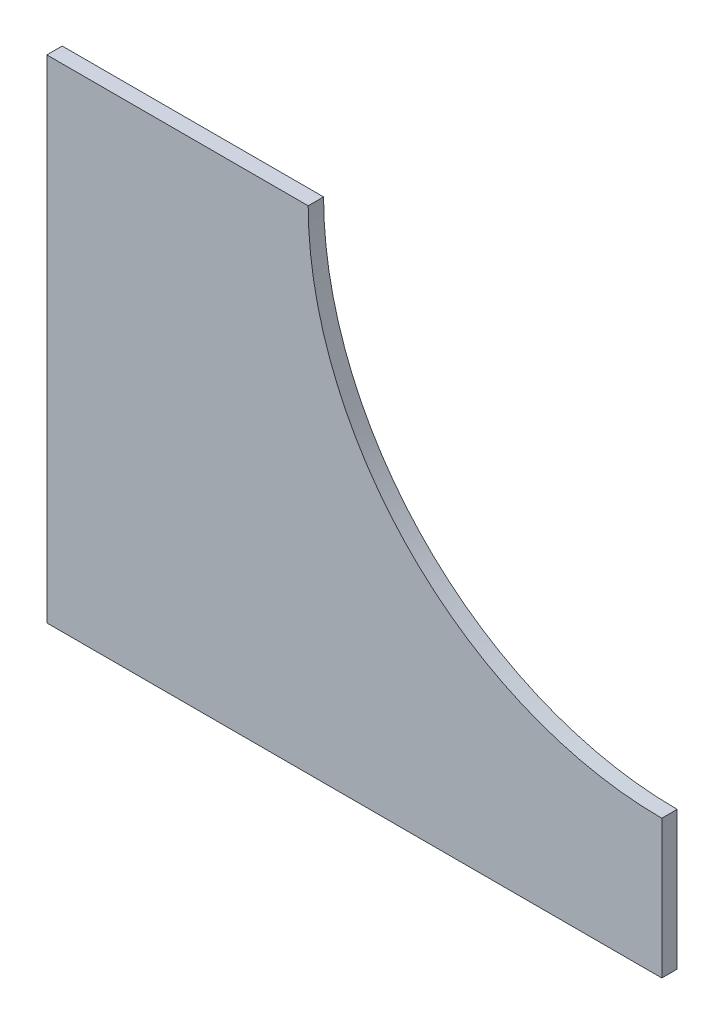
ISO-10303-21;
HEADER;
FILE_DESCRIPTION(('STEP AP214'),'2;1');
FILE_NAME('part.step','',(''),(''),'','','');
FILE_SCHEMA(('AUTOMOTIVE_DESIGN { 1 0 10303 214 1 1 1 1 }'));
ENDSEC;
DATA;
#1=APPLICATION_CONTEXT('core data for automotive mechanical design processes');
#2=APPLICATION_PROTOCOL_DEFINITION('international standard','automotive_design',2000,#1);
#3=PRODUCT_CONTEXT('',#1,'mechanical');
#4=PRODUCT('Part','Part','',(#3));
#5=PRODUCT_RELATED_PRODUCT_CATEGORY('part','',(#4));
#6=PRODUCT_DEFINITION_FORMATION('','',#4);
#7=PRODUCT_DEFINITION_CONTEXT('part definition',#1,'design');
#8=PRODUCT_DEFINITION('design','',#6,#7);
#9=PRODUCT_DEFINITION_SHAPE('','',#8);
#10=(LENGTH_UNIT() NAMED_UNIT(*) SI_UNIT(.MILLI.,.METRE.));
#11=(NAMED_UNIT(*) PLANE_ANGLE_UNIT() SI_UNIT($,.RADIAN.));
#12=(NAMED_UNIT(*) SI_UNIT($,.STERADIAN.) SOLID_ANGLE_UNIT());
#13=UNCERTAINTY_MEASURE_WITH_UNIT(LENGTH_MEASURE(1.E-05),#10,'distance_accuracy_value','');
#14=(GEOMETRIC_REPRESENTATION_CONTEXT(3) GLOBAL_UNCERTAINTY_ASSIGNED_CONTEXT((#13)) GLOBAL_UNIT_ASSIGNED_CONTEXT((#10,
#11,#12)) REPRESENTATION_CONTEXT('',''));
#15=CARTESIAN_POINT('',(0.,0.,0.));
#16=DIRECTION('',(0.,0.,1.));
#17=DIRECTION('',(1.,0.,0.));
#18=AXIS2_PLACEMENT_3D('',#15,#16,#17);
#19=CARTESIAN_POINT('',(98.4294784744164,-123.629958099048,-3.175));
#20=DIRECTION('',(0.,0.,1.));
#21=DIRECTION('',(-1.,0.,0.));
#22=AXIS2_PLACEMENT_3D('',#19,#20,#21);
#23=CYLINDRICAL_SURFACE('',#22,73.0250000000014);
#24=CARTESIAN_POINT('',(98.4294784744164,-123.629958099048,0.));
#25=DIRECTION('',(0.,0.,-1.));
#26=DIRECTION('',(-1.,0.,0.));
#27=AXIS2_PLACEMENT_3D('',#24,#25,#26);
#28=CIRCLE('',#27,73.0250000000014);
#29=CARTESIAN_POINT('',(98.4294784744164,-196.654958099049,0.));
#30=VERTEX_POINT('',#29);
#31=CARTESIAN_POINT('',(25.404478474415,-123.62995809905,0.));
#32=VERTEX_POINT('',#31);
#33=EDGE_CURVE('E112',#30,#32,#28,.T.);
#34=ORIENTED_EDGE('',*,*,#33,.F.);
#35=DIRECTION('',(0.,0.,1.));
#36=VECTOR('',#35,1.);
#37=CARTESIAN_POINT('',(98.4294784744164,-196.654958099049,-3.175));
#38=LINE('',#37,#36);
#39=CARTESIAN_POINT('',(98.4294784744164,-196.654958099049,-3.175));
#40=VERTEX_POINT('',#39);
#41=EDGE_CURVE('E111',#40,#30,#38,.T.);
#42=ORIENTED_EDGE('',*,*,#41,.F.);
#43=CARTESIAN_POINT('',(98.4294784744164,-123.629958099048,-3.175));
#44=DIRECTION('',(0.,0.,-1.));
#45=DIRECTION('',(-1.,0.,0.));
#46=AXIS2_PLACEMENT_3D('',#43,#44,#45);
#47=CIRCLE('',#46,73.0250000000014);
#48=CARTESIAN_POINT('',(25.404478474415,-123.62995809905,-3.175));
#49=VERTEX_POINT('',#48);
#50=EDGE_CURVE('E106',#40,#49,#47,.T.);
#51=ORIENTED_EDGE('',*,*,#50,.T.);
#52=DIRECTION('',(0.,0.,1.));
#53=VECTOR('',#52,1.);
#54=CARTESIAN_POINT('',(25.404478474415,-123.62995809905,-3.175));
#55=LINE('',#54,#53);
#56=EDGE_CURVE('E11',#49,#32,#55,.T.);
#57=ORIENTED_EDGE('',*,*,#56,.T.);
#58=EDGE_LOOP('',(#34,#42,#51,#57));
#59=FACE_BOUND('',#58,.T.);
#60=ADVANCED_FACE('F37',(#59),#23,.F.);
#61=CARTESIAN_POINT('',(-28.570521525585,-123.62995809905,-3.175));
#62=DIRECTION('',(0.,-1.,0.));
#63=DIRECTION('',(1.,0.,0.));
#64=AXIS2_PLACEMENT_3D('',#61,#62,#63);
#65=PLANE('',#64);
#66=DIRECTION('',(-1.,0.,0.));
#67=VECTOR('',#66,1.);
#68=CARTESIAN_POINT('',(-28.570521525585,-123.62995809905,0.));
#69=LINE('',#68,#67);
#70=CARTESIAN_POINT('',(-28.570521525585,-123.62995809905,0.));
#71=VERTEX_POINT('',#70);
#72=EDGE_CURVE('E114',#32,#71,#69,.T.);
#73=ORIENTED_EDGE('',*,*,#72,.F.);
#74=ORIENTED_EDGE('',*,*,#56,.F.);
#75=DIRECTION('',(-1.,0.,0.));
#76=VECTOR('',#75,1.);
#77=CARTESIAN_POINT('',(-28.570521525585,-123.62995809905,-3.175));
#78=LINE('',#77,#76);
#79=CARTESIAN_POINT('',(-28.570521525585,-123.62995809905,-3.175));
#80=VERTEX_POINT('',#79);
#81=EDGE_CURVE('E82',#49,#80,#78,.T.);
#82=ORIENTED_EDGE('',*,*,#81,.T.);
#83=DIRECTION('',(0.,0.,1.));
#84=VECTOR('',#83,1.);
#85=CARTESIAN_POINT('',(-28.570521525585,-123.62995809905,-3.175));
#86=LINE('',#85,#84);
#87=EDGE_CURVE('E45',#80,#71,#86,.T.);
#88=ORIENTED_EDGE('',*,*,#87,.T.);
#89=EDGE_LOOP('',(#73,#74,#82,#88));
#90=FACE_BOUND('',#89,.T.);
#91=ADVANCED_FACE('F123',(#90),#65,.F.);
#92=CARTESIAN_POINT('',(-28.570521525585,-225.22995809905,-3.175));
#93=DIRECTION('',(1.,0.,0.));
#94=DIRECTION('',(0.,1.,0.));
#95=AXIS2_PLACEMENT_3D('',#92,#93,#94);
#96=PLANE('',#95);
#97=DIRECTION('',(0.,-1.,0.));
#98=VECTOR('',#97,1.);
#99=CARTESIAN_POINT('',(-28.570521525585,-225.22995809905,0.));
#100=LINE('',#99,#98);
#101=CARTESIAN_POINT('',(-28.570521525585,-225.22995809905,0.));
#102=VERTEX_POINT('',#101);
#103=EDGE_CURVE('E117',#71,#102,#100,.T.);
#104=ORIENTED_EDGE('',*,*,#103,.F.);
#105=ORIENTED_EDGE('',*,*,#87,.F.);
#106=DIRECTION('',(0.,-1.,0.));
#107=VECTOR('',#106,1.);
#108=CARTESIAN_POINT('',(-28.570521525585,-225.22995809905,-3.175));
#109=LINE('',#108,#107);
#110=CARTESIAN_POINT('',(-28.570521525585,-225.22995809905,-3.175));
#111=VERTEX_POINT('',#110);
#112=EDGE_CURVE('E91',#80,#111,#109,.T.);
#113=ORIENTED_EDGE('',*,*,#112,.T.);
#114=DIRECTION('',(0.,0.,1.));
#115=VECTOR('',#114,1.);
#116=CARTESIAN_POINT('',(-28.570521525585,-225.22995809905,-3.175));
#117=LINE('',#116,#115);
#118=EDGE_CURVE('E96',#111,#102,#117,.T.);
#119=ORIENTED_EDGE('',*,*,#118,.T.);
#120=EDGE_LOOP('',(#104,#105,#113,#119));
#121=FACE_BOUND('',#120,.T.);
#122=ADVANCED_FACE('F103',(#121),#96,.F.);
#123=CARTESIAN_POINT('',(98.4294784744164,-225.22995809905,-3.175));
#124=DIRECTION('',(0.,1.,0.));
#125=DIRECTION('',(0.,0.,-1.));
#126=AXIS2_PLACEMENT_3D('',#123,#124,#125);
#127=PLANE('',#126);
#128=DIRECTION('',(1.,0.,0.));
#129=VECTOR('',#128,1.);
#130=CARTESIAN_POINT('',(98.4294784744164,-225.22995809905,0.));
#131=LINE('',#130,#129);
#132=CARTESIAN_POINT('',(98.4294784744164,-225.22995809905,0.));
#133=VERTEX_POINT('',#132);
#134=EDGE_CURVE('E98',#102,#133,#131,.T.);
#135=ORIENTED_EDGE('',*,*,#134,.F.);
#136=ORIENTED_EDGE('',*,*,#118,.F.);
#137=DIRECTION('',(1.,0.,0.));
#138=VECTOR('',#137,1.);
#139=CARTESIAN_POINT('',(98.4294784744164,-225.22995809905,-3.175));
#140=LINE('',#139,#138);
#141=CARTESIAN_POINT('',(98.4294784744164,-225.22995809905,-3.175));
#142=VERTEX_POINT('',#141);
#143=EDGE_CURVE('E87',#111,#142,#140,.T.);
#144=ORIENTED_EDGE('',*,*,#143,.T.);
#145=DIRECTION('',(0.,0.,1.));
#146=VECTOR('',#145,1.);
#147=CARTESIAN_POINT('',(98.4294784744164,-225.22995809905,-3.175));
#148=LINE('',#147,#146);
#149=EDGE_CURVE('E101',#142,#133,#148,.T.);
#150=ORIENTED_EDGE('',*,*,#149,.T.);
#151=EDGE_LOOP('',(#135,#136,#144,#150));
#152=FACE_BOUND('',#151,.T.);
#153=ADVANCED_FACE('F97',(#152),#127,.F.);
#154=CARTESIAN_POINT('',(98.4294784744164,-196.654958099049,-3.175));
#155=DIRECTION('',(-1.,0.,0.));
#156=DIRECTION('',(0.,0.,-1.));
#157=AXIS2_PLACEMENT_3D('',#154,#155,#156);
#158=PLANE('',#157);
#159=DIRECTION('',(0.,1.,0.));
#160=VECTOR('',#159,1.);
#161=CARTESIAN_POINT('',(98.4294784744164,-196.654958099049,0.));
#162=LINE('',#161,#160);
#163=EDGE_CURVE('E70',#133,#30,#162,.T.);
#164=ORIENTED_EDGE('',*,*,#163,.F.);
#165=ORIENTED_EDGE('',*,*,#149,.F.);
#166=DIRECTION('',(0.,1.,0.));
#167=VECTOR('',#166,1.);
#168=CARTESIAN_POINT('',(98.4294784744164,-196.654958099049,-3.175));
#169=LINE('',#168,#167);
#170=EDGE_CURVE('E53',#142,#40,#169,.T.);
#171=ORIENTED_EDGE('',*,*,#170,.T.);
#172=ORIENTED_EDGE('',*,*,#41,.T.);
#173=EDGE_LOOP('',(#164,#165,#171,#172));
#174=FACE_BOUND('',#173,.T.);
#175=ADVANCED_FACE('F129',(#174),#158,.F.);
#176=CARTESIAN_POINT('',(98.4294784744164,-123.629958099048,-3.175));
#177=DIRECTION('',(0.,0.,1.));
#178=DIRECTION('',(-1.,0.,0.));
#179=AXIS2_PLACEMENT_3D('',#176,#177,#178);
#180=PLANE('',#179);
#181=ORIENTED_EDGE('',*,*,#50,.F.);
#182=ORIENTED_EDGE('',*,*,#170,.F.);
#183=ORIENTED_EDGE('',*,*,#143,.F.);
#184=ORIENTED_EDGE('',*,*,#112,.F.);
#185=ORIENTED_EDGE('',*,*,#81,.F.);
#186=EDGE_LOOP('',(#181,#182,#183,#184,#185));
#187=FACE_BOUND('',#186,.T.);
#188=ADVANCED_FACE('F89',(#187),#180,.F.);
#189=CARTESIAN_POINT('',(98.4294784744164,-123.629958099048,0.));
#190=DIRECTION('',(0.,0.,1.));
#191=DIRECTION('',(-1.,0.,0.));
#192=AXIS2_PLACEMENT_3D('',#189,#190,#191);
#193=PLANE('',#192);
#194=ORIENTED_EDGE('',*,*,#33,.T.);
#195=ORIENTED_EDGE('',*,*,#72,.T.);
#196=ORIENTED_EDGE('',*,*,#103,.T.);
#197=ORIENTED_EDGE('',*,*,#134,.T.);
#198=ORIENTED_EDGE('',*,*,#163,.T.);
#199=EDGE_LOOP('',(#194,#195,#196,#197,#198));
#200=FACE_BOUND('',#199,.T.);
#201=ADVANCED_FACE('F124',(#200),#193,.T.);
#202=CLOSED_SHELL('',(#60,#91,#122,#153,#175,#188,#201));
#203=MANIFOLD_SOLID_BREP('B2',#202);
#204=ADVANCED_BREP_SHAPE_REPRESENTATION('',(#18,#203),#14);
#205=SHAPE_DEFINITION_REPRESENTATION(#9,#204);
ENDSEC;
END-ISO-10303-21;
